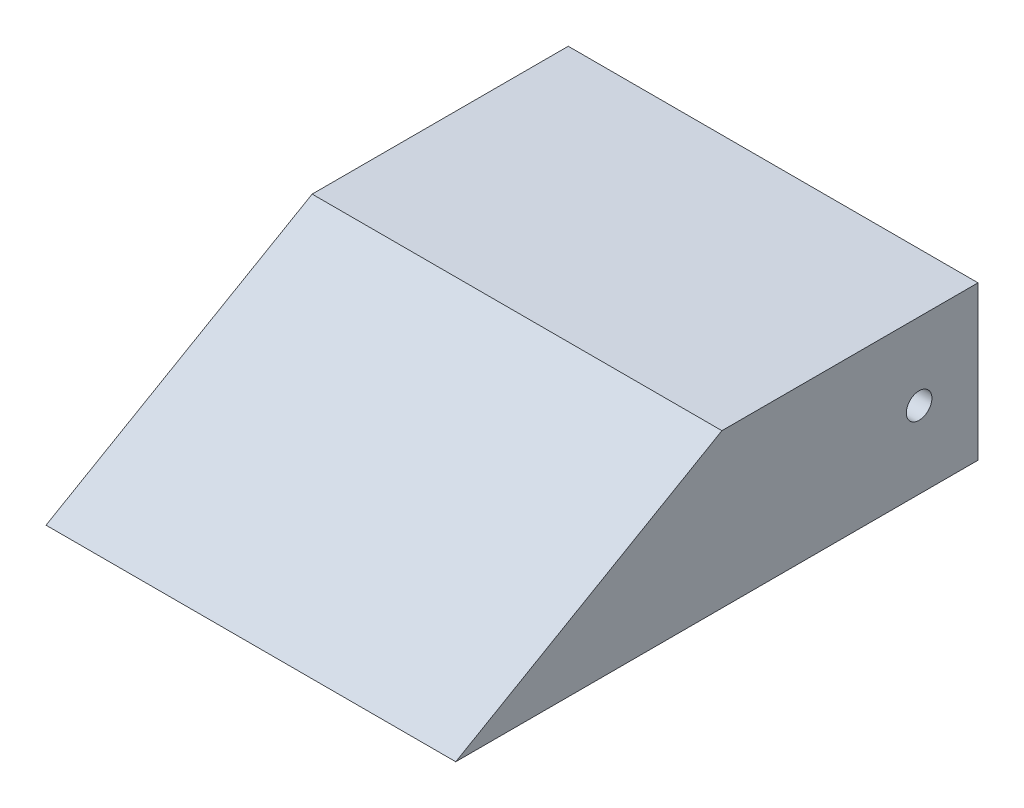
ISO-10303-21;
HEADER;
FILE_DESCRIPTION(('STEP AP214'),'2;1');
FILE_NAME('part.step','',(''),(''),'','','');
FILE_SCHEMA(('AUTOMOTIVE_DESIGN { 1 0 10303 214 1 1 1 1 }'));
ENDSEC;
DATA;
#1=APPLICATION_CONTEXT('core data for automotive mechanical design processes');
#2=APPLICATION_PROTOCOL_DEFINITION('international standard','automotive_design',2000,#1);
#3=PRODUCT_CONTEXT('',#1,'mechanical');
#4=PRODUCT('Part','Part','',(#3));
#5=PRODUCT_RELATED_PRODUCT_CATEGORY('part','',(#4));
#6=PRODUCT_DEFINITION_FORMATION('','',#4);
#7=PRODUCT_DEFINITION_CONTEXT('part definition',#1,'design');
#8=PRODUCT_DEFINITION('design','',#6,#7);
#9=PRODUCT_DEFINITION_SHAPE('','',#8);
#10=(LENGTH_UNIT() NAMED_UNIT(*) SI_UNIT(.MILLI.,.METRE.));
#11=(NAMED_UNIT(*) PLANE_ANGLE_UNIT() SI_UNIT($,.RADIAN.));
#12=(NAMED_UNIT(*) SI_UNIT($,.STERADIAN.) SOLID_ANGLE_UNIT());
#13=UNCERTAINTY_MEASURE_WITH_UNIT(LENGTH_MEASURE(1.E-05),#10,'distance_accuracy_value','');
#14=(GEOMETRIC_REPRESENTATION_CONTEXT(3) GLOBAL_UNCERTAINTY_ASSIGNED_CONTEXT((#13)) GLOBAL_UNIT_ASSIGNED_CONTEXT((#10,
#11,#12)) REPRESENTATION_CONTEXT('',''));
#15=CARTESIAN_POINT('',(0.,0.,0.));
#16=DIRECTION('',(0.,0.,1.));
#17=DIRECTION('',(1.,0.,0.));
#18=AXIS2_PLACEMENT_3D('',#15,#16,#17);
#19=CARTESIAN_POINT('',(80.,-30.,230.));
#20=DIRECTION('',(-1.,0.,0.));
#21=DIRECTION('',(0.,0.,1.));
#22=AXIS2_PLACEMENT_3D('',#19,#20,#21);
#23=PLANE('',#22);
#24=CARTESIAN_POINT('',(80.,0.,23.));
#25=DIRECTION('',(1.,0.,0.));
#26=DIRECTION('',(0.,0.,-1.));
#27=AXIS2_PLACEMENT_3D('',#24,#25,#26);
#28=CIRCLE('',#27,5.);
#29=CARTESIAN_POINT('',(80.,0.,18.));
#30=VERTEX_POINT('',#29);
#31=EDGE_CURVE('E184',#30,#30,#28,.T.);
#32=ORIENTED_EDGE('',*,*,#31,.F.);
#33=EDGE_LOOP('',(#32));
#34=FACE_BOUND('',#33,.T.);
#35=DIRECTION('',(0.,0.,-1.));
#36=VECTOR('',#35,1.);
#37=CARTESIAN_POINT('',(80.,30.,230.));
#38=LINE('',#37,#36);
#39=CARTESIAN_POINT('',(80.,30.,100.));
#40=VERTEX_POINT('',#39);
#41=CARTESIAN_POINT('',(80.,30.,0.));
#42=VERTEX_POINT('',#41);
#43=EDGE_CURVE('E11',#40,#42,#38,.T.);
#44=ORIENTED_EDGE('',*,*,#43,.F.);
#45=DIRECTION('',(0.,0.499999999999995,-0.866025403784442));
#46=VECTOR('',#45,1.);
#47=CARTESIAN_POINT('',(80.,30.,100.));
#48=LINE('',#47,#46);
#49=CARTESIAN_POINT('',(80.,-30.,203.923048454134));
#50=VERTEX_POINT('',#49);
#51=EDGE_CURVE('E135',#50,#40,#48,.T.);
#52=ORIENTED_EDGE('',*,*,#51,.F.);
#53=DIRECTION('',(0.,0.,-1.));
#54=VECTOR('',#53,1.);
#55=CARTESIAN_POINT('',(80.,-30.,230.));
#56=LINE('',#55,#54);
#57=CARTESIAN_POINT('',(80.,-30.,0.));
#58=VERTEX_POINT('',#57);
#59=EDGE_CURVE('E154',#50,#58,#56,.T.);
#60=ORIENTED_EDGE('',*,*,#59,.T.);
#61=DIRECTION('',(0.,1.,0.));
#62=VECTOR('',#61,1.);
#63=CARTESIAN_POINT('',(80.,-30.,0.));
#64=LINE('',#63,#62);
#65=EDGE_CURVE('E141',#58,#42,#64,.T.);
#66=ORIENTED_EDGE('',*,*,#65,.T.);
#67=EDGE_LOOP('',(#44,#52,#60,#66));
#68=FACE_BOUND('',#67,.T.);
#69=ADVANCED_FACE('F32',(#34,#68),#23,.F.);
#70=CARTESIAN_POINT('',(-80.,30.,230.));
#71=DIRECTION('',(0.,-1.,0.));
#72=DIRECTION('',(0.,0.,-1.));
#73=AXIS2_PLACEMENT_3D('',#70,#71,#72);
#74=PLANE('',#73);
#75=DIRECTION('',(0.,0.,-1.));
#76=VECTOR('',#75,1.);
#77=CARTESIAN_POINT('',(-80.,30.,230.));
#78=LINE('',#77,#76);
#79=CARTESIAN_POINT('',(-80.,30.,100.));
#80=VERTEX_POINT('',#79);
#81=CARTESIAN_POINT('',(-80.,30.,0.));
#82=VERTEX_POINT('',#81);
#83=EDGE_CURVE('E40',#80,#82,#78,.T.);
#84=ORIENTED_EDGE('',*,*,#83,.F.);
#85=DIRECTION('',(1.,0.,0.));
#86=VECTOR('',#85,1.);
#87=CARTESIAN_POINT('',(-80.001,30.,100.));
#88=LINE('',#87,#86);
#89=EDGE_CURVE('E138',#80,#40,#88,.T.);
#90=ORIENTED_EDGE('',*,*,#89,.T.);
#91=ORIENTED_EDGE('',*,*,#43,.T.);
#92=DIRECTION('',(-1.,0.,0.));
#93=VECTOR('',#92,1.);
#94=CARTESIAN_POINT('',(-80.,30.,0.));
#95=LINE('',#94,#93);
#96=EDGE_CURVE('E145',#42,#82,#95,.T.);
#97=ORIENTED_EDGE('',*,*,#96,.T.);
#98=EDGE_LOOP('',(#84,#90,#91,#97));
#99=FACE_BOUND('',#98,.T.);
#100=ADVANCED_FACE('F166',(#99),#74,.F.);
#101=CARTESIAN_POINT('',(-80.,-30.,230.));
#102=DIRECTION('',(1.,0.,0.));
#103=DIRECTION('',(0.,0.,-1.));
#104=AXIS2_PLACEMENT_3D('',#101,#102,#103);
#105=PLANE('',#104);
#106=CARTESIAN_POINT('',(-80.,0.,23.));
#107=DIRECTION('',(1.,0.,0.));
#108=DIRECTION('',(0.,0.,-1.));
#109=AXIS2_PLACEMENT_3D('',#106,#107,#108);
#110=CIRCLE('',#109,5.);
#111=CARTESIAN_POINT('',(-80.,0.,18.));
#112=VERTEX_POINT('',#111);
#113=EDGE_CURVE('E186',#112,#112,#110,.T.);
#114=ORIENTED_EDGE('',*,*,#113,.T.);
#115=EDGE_LOOP('',(#114));
#116=FACE_BOUND('',#115,.T.);
#117=DIRECTION('',(0.,0.,-1.));
#118=VECTOR('',#117,1.);
#119=CARTESIAN_POINT('',(-80.,-30.,230.));
#120=LINE('',#119,#118);
#121=CARTESIAN_POINT('',(-80.,-30.,203.923048454134));
#122=VERTEX_POINT('',#121);
#123=CARTESIAN_POINT('',(-80.,-30.,0.));
#124=VERTEX_POINT('',#123);
#125=EDGE_CURVE('E156',#122,#124,#120,.T.);
#126=ORIENTED_EDGE('',*,*,#125,.F.);
#127=DIRECTION('',(0.,-0.499999999999995,0.866025403784442));
#128=VECTOR('',#127,1.);
#129=CARTESIAN_POINT('',(-80.,30.,100.));
#130=LINE('',#129,#128);
#131=EDGE_CURVE('E55',#80,#122,#130,.T.);
#132=ORIENTED_EDGE('',*,*,#131,.F.);
#133=ORIENTED_EDGE('',*,*,#83,.T.);
#134=DIRECTION('',(0.,-1.,0.));
#135=VECTOR('',#134,1.);
#136=CARTESIAN_POINT('',(-80.,-30.,0.));
#137=LINE('',#136,#135);
#138=EDGE_CURVE('E148',#82,#124,#137,.T.);
#139=ORIENTED_EDGE('',*,*,#138,.T.);
#140=EDGE_LOOP('',(#126,#132,#133,#139));
#141=FACE_BOUND('',#140,.T.);
#142=ADVANCED_FACE('F161',(#116,#141),#105,.F.);
#143=CARTESIAN_POINT('',(-80.,-30.,230.));
#144=DIRECTION('',(0.,1.,0.));
#145=DIRECTION('',(0.,0.,1.));
#146=AXIS2_PLACEMENT_3D('',#143,#144,#145);
#147=PLANE('',#146);
#148=DIRECTION('',(1.,0.,0.));
#149=VECTOR('',#148,1.);
#150=CARTESIAN_POINT('',(-80.001,-30.,183.923048454134));
#151=LINE('',#150,#149);
#152=CARTESIAN_POINT('',(-70.,-30.,183.923048454134));
#153=VERTEX_POINT('',#152);
#154=CARTESIAN_POINT('',(70.,-30.,183.923048454134));
#155=VERTEX_POINT('',#154);
#156=EDGE_CURVE('E118',#153,#155,#151,.T.);
#157=ORIENTED_EDGE('',*,*,#156,.T.);
#158=DIRECTION('',(0.,0.,-1.));
#159=VECTOR('',#158,1.);
#160=CARTESIAN_POINT('',(70.,-30.,230.));
#161=LINE('',#160,#159);
#162=CARTESIAN_POINT('',(70.,-30.,10.));
#163=VERTEX_POINT('',#162);
#164=EDGE_CURVE('E128',#155,#163,#161,.T.);
#165=ORIENTED_EDGE('',*,*,#164,.T.);
#166=DIRECTION('',(1.,0.,0.));
#167=VECTOR('',#166,1.);
#168=CARTESIAN_POINT('',(0.,-30.,10.));
#169=LINE('',#168,#167);
#170=CARTESIAN_POINT('',(-70.,-30.,10.));
#171=VERTEX_POINT('',#170);
#172=EDGE_CURVE('E115',#171,#163,#169,.T.);
#173=ORIENTED_EDGE('',*,*,#172,.F.);
#174=DIRECTION('',(0.,0.,-1.));
#175=VECTOR('',#174,1.);
#176=CARTESIAN_POINT('',(-70.,-30.,230.));
#177=LINE('',#176,#175);
#178=EDGE_CURVE('E122',#153,#171,#177,.T.);
#179=ORIENTED_EDGE('',*,*,#178,.F.);
#180=EDGE_LOOP('',(#157,#165,#173,#179));
#181=FACE_BOUND('',#180,.T.);
#182=ORIENTED_EDGE('',*,*,#59,.F.);
#183=DIRECTION('',(1.,0.,0.));
#184=VECTOR('',#183,1.);
#185=CARTESIAN_POINT('',(-80.001,-30.,203.923048454134));
#186=LINE('',#185,#184);
#187=EDGE_CURVE('E137',#122,#50,#186,.T.);
#188=ORIENTED_EDGE('',*,*,#187,.F.);
#189=ORIENTED_EDGE('',*,*,#125,.T.);
#190=DIRECTION('',(1.,0.,0.));
#191=VECTOR('',#190,1.);
#192=CARTESIAN_POINT('',(-80.,-30.,0.));
#193=LINE('',#192,#191);
#194=EDGE_CURVE('E151',#124,#58,#193,.T.);
#195=ORIENTED_EDGE('',*,*,#194,.T.);
#196=EDGE_LOOP('',(#182,#188,#189,#195));
#197=FACE_BOUND('',#196,.T.);
#198=ADVANCED_FACE('F173',(#181,#197),#147,.F.);
#199=CARTESIAN_POINT('',(0.,0.,0.));
#200=DIRECTION('',(0.,0.,-1.));
#201=DIRECTION('',(-1.,0.,0.));
#202=AXIS2_PLACEMENT_3D('',#199,#200,#201);
#203=PLANE('',#202);
#204=ORIENTED_EDGE('',*,*,#65,.F.);
#205=ORIENTED_EDGE('',*,*,#194,.F.);
#206=ORIENTED_EDGE('',*,*,#138,.F.);
#207=ORIENTED_EDGE('',*,*,#96,.F.);
#208=EDGE_LOOP('',(#204,#205,#206,#207));
#209=FACE_BOUND('',#208,.T.);
#210=ADVANCED_FACE('F170',(#209),#203,.T.);
#211=CARTESIAN_POINT('',(-80.001,30.,100.));
#212=DIRECTION('',(0.,-0.866025403784442,-0.499999999999995));
#213=DIRECTION('',(0.,0.499999999999995,-0.866025403784442));
#214=AXIS2_PLACEMENT_3D('',#211,#212,#213);
#215=PLANE('',#214);
#216=ORIENTED_EDGE('',*,*,#131,.T.);
#217=ORIENTED_EDGE('',*,*,#187,.T.);
#218=ORIENTED_EDGE('',*,*,#51,.T.);
#219=ORIENTED_EDGE('',*,*,#89,.F.);
#220=EDGE_LOOP('',(#216,#217,#218,#219));
#221=FACE_BOUND('',#220,.T.);
#222=ADVANCED_FACE('F175',(#221),#215,.F.);
#223=CARTESIAN_POINT('',(70.,-30.,230.));
#224=DIRECTION('',(-1.,0.,0.));
#225=DIRECTION('',(0.,0.,1.));
#226=AXIS2_PLACEMENT_3D('',#223,#224,#225);
#227=PLANE('',#226);
#228=CARTESIAN_POINT('',(70.,0.,23.));
#229=DIRECTION('',(-1.,0.,0.));
#230=DIRECTION('',(0.,0.,1.));
#231=AXIS2_PLACEMENT_3D('',#228,#229,#230);
#232=CIRCLE('',#231,5.);
#233=CARTESIAN_POINT('',(70.,0.,28.));
#234=VERTEX_POINT('',#233);
#235=EDGE_CURVE('E126',#234,#234,#232,.T.);
#236=ORIENTED_EDGE('',*,*,#235,.F.);
#237=EDGE_LOOP('',(#236));
#238=FACE_BOUND('',#237,.T.);
#239=DIRECTION('',(0.,0.,-1.));
#240=VECTOR('',#239,1.);
#241=CARTESIAN_POINT('',(70.,20.,230.));
#242=LINE('',#241,#240);
#243=CARTESIAN_POINT('',(70.,20.,97.3205080756888));
#244=VERTEX_POINT('',#243);
#245=CARTESIAN_POINT('',(70.,20.,10.));
#246=VERTEX_POINT('',#245);
#247=EDGE_CURVE('E97',#244,#246,#242,.T.);
#248=ORIENTED_EDGE('',*,*,#247,.T.);
#249=DIRECTION('',(0.,1.,0.));
#250=VECTOR('',#249,1.);
#251=CARTESIAN_POINT('',(70.,0.,10.));
#252=LINE('',#251,#250);
#253=EDGE_CURVE('E102',#163,#246,#252,.T.);
#254=ORIENTED_EDGE('',*,*,#253,.F.);
#255=ORIENTED_EDGE('',*,*,#164,.F.);
#256=DIRECTION('',(0.,0.499999999999995,-0.866025403784442));
#257=VECTOR('',#256,1.);
#258=CARTESIAN_POINT('',(70.,21.3397459621556,95.0000000000001));
#259=LINE('',#258,#257);
#260=EDGE_CURVE('E104',#155,#244,#259,.T.);
#261=ORIENTED_EDGE('',*,*,#260,.T.);
#262=EDGE_LOOP('',(#248,#254,#255,#261));
#263=FACE_BOUND('',#262,.T.);
#264=ADVANCED_FACE('F99',(#238,#263),#227,.T.);
#265=CARTESIAN_POINT('',(-80.,20.,230.));
#266=DIRECTION('',(0.,-1.,0.));
#267=DIRECTION('',(0.,0.,-1.));
#268=AXIS2_PLACEMENT_3D('',#265,#266,#267);
#269=PLANE('',#268);
#270=DIRECTION('',(0.,0.,-1.));
#271=VECTOR('',#270,1.);
#272=CARTESIAN_POINT('',(-70.,20.,230.));
#273=LINE('',#272,#271);
#274=CARTESIAN_POINT('',(-70.,20.,97.3205080756888));
#275=VERTEX_POINT('',#274);
#276=CARTESIAN_POINT('',(-70.,20.,10.));
#277=VERTEX_POINT('',#276);
#278=EDGE_CURVE('E107',#275,#277,#273,.T.);
#279=ORIENTED_EDGE('',*,*,#278,.T.);
#280=DIRECTION('',(-1.,0.,0.));
#281=VECTOR('',#280,1.);
#282=CARTESIAN_POINT('',(0.,20.,10.));
#283=LINE('',#282,#281);
#284=EDGE_CURVE('E109',#246,#277,#283,.T.);
#285=ORIENTED_EDGE('',*,*,#284,.F.);
#286=ORIENTED_EDGE('',*,*,#247,.F.);
#287=DIRECTION('',(1.,0.,0.));
#288=VECTOR('',#287,1.);
#289=CARTESIAN_POINT('',(-80.,20.,97.3205080756888));
#290=LINE('',#289,#288);
#291=EDGE_CURVE('E116',#275,#244,#290,.T.);
#292=ORIENTED_EDGE('',*,*,#291,.F.);
#293=EDGE_LOOP('',(#279,#285,#286,#292));
#294=FACE_BOUND('',#293,.T.);
#295=ADVANCED_FACE('F110',(#294),#269,.T.);
#296=CARTESIAN_POINT('',(-70.,-30.,230.));
#297=DIRECTION('',(1.,0.,0.));
#298=DIRECTION('',(0.,0.,-1.));
#299=AXIS2_PLACEMENT_3D('',#296,#297,#298);
#300=PLANE('',#299);
#301=CARTESIAN_POINT('',(-70.,0.,23.));
#302=DIRECTION('',(1.,0.,0.));
#303=DIRECTION('',(0.,0.,-1.));
#304=AXIS2_PLACEMENT_3D('',#301,#302,#303);
#305=CIRCLE('',#304,5.);
#306=CARTESIAN_POINT('',(-70.,0.,18.));
#307=VERTEX_POINT('',#306);
#308=EDGE_CURVE('E35',#307,#307,#305,.T.);
#309=ORIENTED_EDGE('',*,*,#308,.F.);
#310=EDGE_LOOP('',(#309));
#311=FACE_BOUND('',#310,.T.);
#312=ORIENTED_EDGE('',*,*,#178,.T.);
#313=DIRECTION('',(0.,-1.,0.));
#314=VECTOR('',#313,1.);
#315=CARTESIAN_POINT('',(-70.,0.,10.));
#316=LINE('',#315,#314);
#317=EDGE_CURVE('E47',#277,#171,#316,.T.);
#318=ORIENTED_EDGE('',*,*,#317,.F.);
#319=ORIENTED_EDGE('',*,*,#278,.F.);
#320=DIRECTION('',(0.,-0.499999999999995,0.866025403784442));
#321=VECTOR('',#320,1.);
#322=CARTESIAN_POINT('',(-70.,21.3397459621556,95.0000000000001));
#323=LINE('',#322,#321);
#324=EDGE_CURVE('E124',#275,#153,#323,.T.);
#325=ORIENTED_EDGE('',*,*,#324,.T.);
#326=EDGE_LOOP('',(#312,#318,#319,#325));
#327=FACE_BOUND('',#326,.T.);
#328=ADVANCED_FACE('F200',(#311,#327),#300,.T.);
#329=CARTESIAN_POINT('',(0.,0.,10.));
#330=DIRECTION('',(0.,0.,-1.));
#331=DIRECTION('',(-1.,0.,0.));
#332=AXIS2_PLACEMENT_3D('',#329,#330,#331);
#333=PLANE('',#332);
#334=ORIENTED_EDGE('',*,*,#253,.T.);
#335=ORIENTED_EDGE('',*,*,#284,.T.);
#336=ORIENTED_EDGE('',*,*,#317,.T.);
#337=ORIENTED_EDGE('',*,*,#172,.T.);
#338=EDGE_LOOP('',(#334,#335,#336,#337));
#339=FACE_BOUND('',#338,.T.);
#340=ADVANCED_FACE('F113',(#339),#333,.F.);
#341=CARTESIAN_POINT('',(-80.001,21.3397459621556,95.0000000000001));
#342=DIRECTION('',(0.,-0.866025403784442,-0.499999999999995));
#343=DIRECTION('',(0.,0.499999999999995,-0.866025403784442));
#344=AXIS2_PLACEMENT_3D('',#341,#342,#343);
#345=PLANE('',#344);
#346=ORIENTED_EDGE('',*,*,#324,.F.);
#347=ORIENTED_EDGE('',*,*,#291,.T.);
#348=ORIENTED_EDGE('',*,*,#260,.F.);
#349=ORIENTED_EDGE('',*,*,#156,.F.);
#350=EDGE_LOOP('',(#346,#347,#348,#349));
#351=FACE_BOUND('',#350,.T.);
#352=ADVANCED_FACE('F209',(#351),#345,.T.);
#353=CARTESIAN_POINT('',(-80.,0.,23.));
#354=DIRECTION('',(1.,0.,0.));
#355=DIRECTION('',(0.,0.,-1.));
#356=AXIS2_PLACEMENT_3D('',#353,#354,#355);
#357=CYLINDRICAL_SURFACE('',#356,5.);
#358=ORIENTED_EDGE('',*,*,#308,.T.);
#359=EDGE_LOOP('',(#358));
#360=FACE_BOUND('',#359,.T.);
#361=ORIENTED_EDGE('',*,*,#113,.F.);
#362=EDGE_LOOP('',(#361));
#363=FACE_BOUND('',#362,.T.);
#364=ADVANCED_FACE('F197',(#360,#363),#357,.F.);
#365=ORIENTED_EDGE('',*,*,#235,.T.);
#366=EDGE_LOOP('',(#365));
#367=FACE_BOUND('',#366,.T.);
#368=ORIENTED_EDGE('',*,*,#31,.T.);
#369=EDGE_LOOP('',(#368));
#370=FACE_BOUND('',#369,.T.);
#371=ADVANCED_FACE('F216',(#367,#370),#357,.F.);
#372=CLOSED_SHELL('',(#69,#100,#142,#198,#210,#222,#264,#295,#328,#340,#352,#364,#371));
#373=MANIFOLD_SOLID_BREP('B2',#372);
#374=ADVANCED_BREP_SHAPE_REPRESENTATION('',(#18,#373),#14);
#375=SHAPE_DEFINITION_REPRESENTATION(#9,#374);
ENDSEC;
END-ISO-10303-21;
